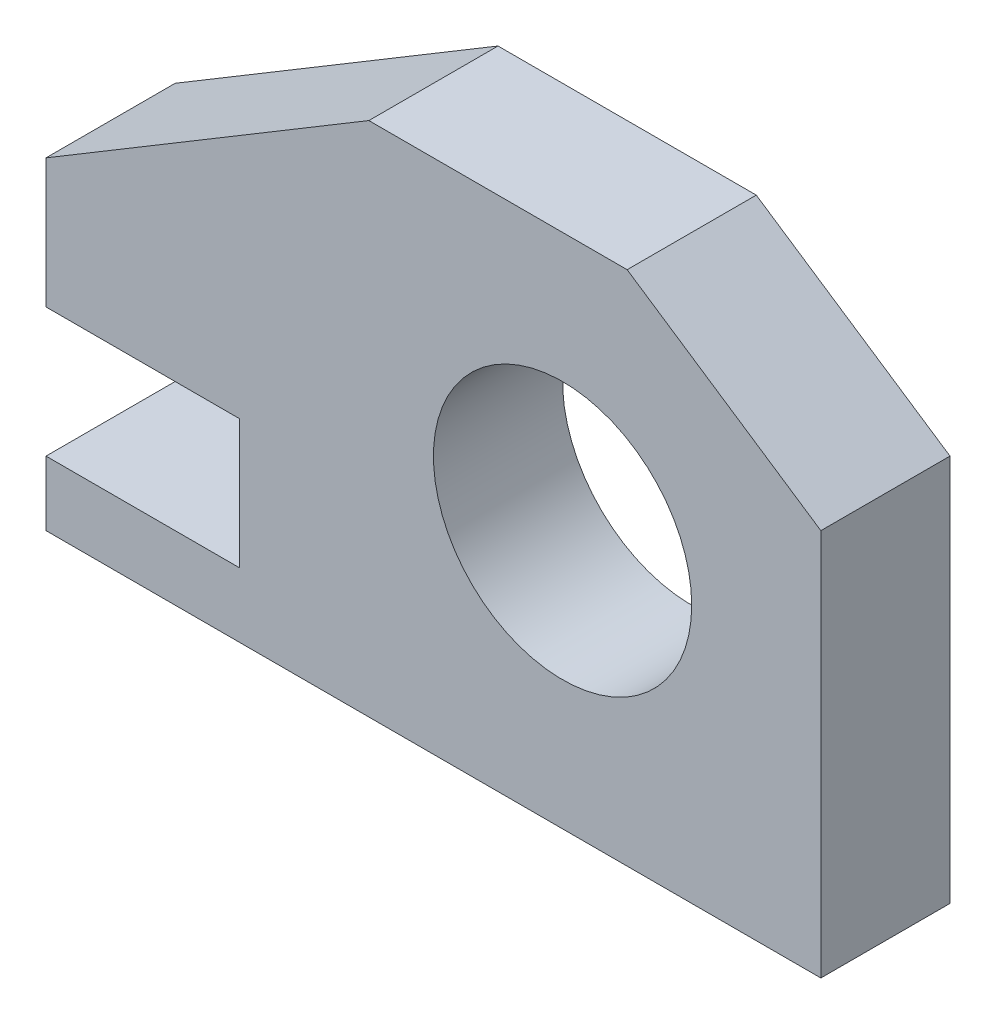
ISO-10303-21;
HEADER;
FILE_DESCRIPTION(('STEP AP214'),'2;1');
FILE_NAME('part.step','',(''),(''),'','','');
FILE_SCHEMA(('AUTOMOTIVE_DESIGN { 1 0 10303 214 1 1 1 1 }'));
ENDSEC;
DATA;
#1=APPLICATION_CONTEXT('core data for automotive mechanical design processes');
#2=APPLICATION_PROTOCOL_DEFINITION('international standard','automotive_design',2000,#1);
#3=PRODUCT_CONTEXT('',#1,'mechanical');
#4=PRODUCT('Part','Part','',(#3));
#5=PRODUCT_RELATED_PRODUCT_CATEGORY('part','',(#4));
#6=PRODUCT_DEFINITION_FORMATION('','',#4);
#7=PRODUCT_DEFINITION_CONTEXT('part definition',#1,'design');
#8=PRODUCT_DEFINITION('design','',#6,#7);
#9=PRODUCT_DEFINITION_SHAPE('','',#8);
#10=(LENGTH_UNIT() NAMED_UNIT(*) SI_UNIT(.MILLI.,.METRE.));
#11=(NAMED_UNIT(*) PLANE_ANGLE_UNIT() SI_UNIT($,.RADIAN.));
#12=(NAMED_UNIT(*) SI_UNIT($,.STERADIAN.) SOLID_ANGLE_UNIT());
#13=UNCERTAINTY_MEASURE_WITH_UNIT(LENGTH_MEASURE(1.E-05),#10,'distance_accuracy_value','');
#14=(GEOMETRIC_REPRESENTATION_CONTEXT(3) GLOBAL_UNCERTAINTY_ASSIGNED_CONTEXT((#13)) GLOBAL_UNIT_ASSIGNED_CONTEXT((#10,
#11,#12)) REPRESENTATION_CONTEXT('',''));
#15=CARTESIAN_POINT('',(0.,0.,0.));
#16=DIRECTION('',(0.,0.,1.));
#17=DIRECTION('',(1.,0.,0.));
#18=AXIS2_PLACEMENT_3D('',#15,#16,#17);
#19=CARTESIAN_POINT('',(57.15,50.8,12.7));
#20=DIRECTION('',(0.,-1.,0.));
#21=DIRECTION('',(0.,0.,-1.));
#22=AXIS2_PLACEMENT_3D('',#19,#20,#21);
#23=PLANE('',#22);
#24=DIRECTION('',(-1.,0.,0.));
#25=VECTOR('',#24,1.);
#26=CARTESIAN_POINT('',(57.15,50.8,0.));
#27=LINE('',#26,#25);
#28=CARTESIAN_POINT('',(57.15,50.8,0.));
#29=VERTEX_POINT('',#28);
#30=CARTESIAN_POINT('',(31.75,50.8,0.));
#31=VERTEX_POINT('',#30);
#32=EDGE_CURVE('E152',#29,#31,#27,.T.);
#33=ORIENTED_EDGE('',*,*,#32,.T.);
#34=DIRECTION('',(0.,0.,-1.));
#35=VECTOR('',#34,1.);
#36=CARTESIAN_POINT('',(31.75,50.8,12.7));
#37=LINE('',#36,#35);
#38=CARTESIAN_POINT('',(31.75,50.8,12.7));
#39=VERTEX_POINT('',#38);
#40=EDGE_CURVE('E11',#39,#31,#37,.T.);
#41=ORIENTED_EDGE('',*,*,#40,.F.);
#42=DIRECTION('',(-1.,0.,0.));
#43=VECTOR('',#42,1.);
#44=CARTESIAN_POINT('',(57.15,50.8,12.7));
#45=LINE('',#44,#43);
#46=CARTESIAN_POINT('',(57.15,50.8,12.7));
#47=VERTEX_POINT('',#46);
#48=EDGE_CURVE('E181',#47,#39,#45,.T.);
#49=ORIENTED_EDGE('',*,*,#48,.F.);
#50=DIRECTION('',(0.,0.,-1.));
#51=VECTOR('',#50,1.);
#52=CARTESIAN_POINT('',(57.15,50.8,12.7));
#53=LINE('',#52,#51);
#54=EDGE_CURVE('E148',#47,#29,#53,.T.);
#55=ORIENTED_EDGE('',*,*,#54,.T.);
#56=EDGE_LOOP('',(#33,#41,#49,#55));
#57=FACE_BOUND('',#56,.T.);
#58=ADVANCED_FACE('F39',(#57),#23,.F.);
#59=CARTESIAN_POINT('',(31.75,50.8,12.7));
#60=DIRECTION('',(0.514495755427526,-0.857492925712544,0.));
#61=DIRECTION('',(0.857492925712544,0.514495755427526,0.));
#62=AXIS2_PLACEMENT_3D('',#59,#60,#61);
#63=PLANE('',#62);
#64=DIRECTION('',(-0.857492925712544,-0.514495755427526,0.));
#65=VECTOR('',#64,1.);
#66=CARTESIAN_POINT('',(31.75,50.8,0.));
#67=LINE('',#66,#65);
#68=CARTESIAN_POINT('',(0.,31.75,0.));
#69=VERTEX_POINT('',#68);
#70=EDGE_CURVE('E156',#31,#69,#67,.T.);
#71=ORIENTED_EDGE('',*,*,#70,.T.);
#72=DIRECTION('',(0.,0.,-1.));
#73=VECTOR('',#72,1.);
#74=CARTESIAN_POINT('',(0.,31.75,12.7));
#75=LINE('',#74,#73);
#76=CARTESIAN_POINT('',(0.,31.75,12.7));
#77=VERTEX_POINT('',#76);
#78=EDGE_CURVE('E48',#77,#69,#75,.T.);
#79=ORIENTED_EDGE('',*,*,#78,.F.);
#80=DIRECTION('',(-0.857492925712544,-0.514495755427526,0.));
#81=VECTOR('',#80,1.);
#82=CARTESIAN_POINT('',(31.75,50.8,12.7));
#83=LINE('',#82,#81);
#84=EDGE_CURVE('E105',#39,#77,#83,.T.);
#85=ORIENTED_EDGE('',*,*,#84,.F.);
#86=ORIENTED_EDGE('',*,*,#40,.T.);
#87=EDGE_LOOP('',(#71,#79,#85,#86));
#88=FACE_BOUND('',#87,.T.);
#89=ADVANCED_FACE('F268',(#88),#63,.F.);
#90=CARTESIAN_POINT('',(0.,31.75,12.7));
#91=DIRECTION('',(1.,0.,0.));
#92=DIRECTION('',(0.,1.,0.));
#93=AXIS2_PLACEMENT_3D('',#90,#91,#92);
#94=PLANE('',#93);
#95=DIRECTION('',(0.,-1.,0.));
#96=VECTOR('',#95,1.);
#97=CARTESIAN_POINT('',(0.,31.75,0.));
#98=LINE('',#97,#96);
#99=CARTESIAN_POINT('',(0.,19.05,0.));
#100=VERTEX_POINT('',#99);
#101=EDGE_CURVE('E160',#69,#100,#98,.T.);
#102=ORIENTED_EDGE('',*,*,#101,.T.);
#103=DIRECTION('',(0.,0.,-1.));
#104=VECTOR('',#103,1.);
#105=CARTESIAN_POINT('',(0.,19.05,12.7));
#106=LINE('',#105,#104);
#107=CARTESIAN_POINT('',(0.,19.05,12.7));
#108=VERTEX_POINT('',#107);
#109=EDGE_CURVE('E200',#108,#100,#106,.T.);
#110=ORIENTED_EDGE('',*,*,#109,.F.);
#111=DIRECTION('',(0.,-1.,0.));
#112=VECTOR('',#111,1.);
#113=CARTESIAN_POINT('',(0.,31.75,12.7));
#114=LINE('',#113,#112);
#115=EDGE_CURVE('E210',#77,#108,#114,.T.);
#116=ORIENTED_EDGE('',*,*,#115,.F.);
#117=ORIENTED_EDGE('',*,*,#78,.T.);
#118=EDGE_LOOP('',(#102,#110,#116,#117));
#119=FACE_BOUND('',#118,.T.);
#120=ADVANCED_FACE('F208',(#119),#94,.F.);
#121=CARTESIAN_POINT('',(0.,19.05,12.7));
#122=DIRECTION('',(0.,1.,0.));
#123=DIRECTION('',(0.,0.,1.));
#124=AXIS2_PLACEMENT_3D('',#121,#122,#123);
#125=PLANE('',#124);
#126=DIRECTION('',(1.,0.,0.));
#127=VECTOR('',#126,1.);
#128=CARTESIAN_POINT('',(0.,19.05,0.));
#129=LINE('',#128,#127);
#130=CARTESIAN_POINT('',(19.05,19.05,0.));
#131=VERTEX_POINT('',#130);
#132=EDGE_CURVE('E163',#100,#131,#129,.T.);
#133=ORIENTED_EDGE('',*,*,#132,.T.);
#134=DIRECTION('',(0.,0.,-1.));
#135=VECTOR('',#134,1.);
#136=CARTESIAN_POINT('',(19.05,19.05,12.7));
#137=LINE('',#136,#135);
#138=CARTESIAN_POINT('',(19.05,19.05,12.7));
#139=VERTEX_POINT('',#138);
#140=EDGE_CURVE('E196',#139,#131,#137,.T.);
#141=ORIENTED_EDGE('',*,*,#140,.F.);
#142=DIRECTION('',(1.,0.,0.));
#143=VECTOR('',#142,1.);
#144=CARTESIAN_POINT('',(0.,19.05,12.7));
#145=LINE('',#144,#143);
#146=EDGE_CURVE('E229',#108,#139,#145,.T.);
#147=ORIENTED_EDGE('',*,*,#146,.F.);
#148=ORIENTED_EDGE('',*,*,#109,.T.);
#149=EDGE_LOOP('',(#133,#141,#147,#148));
#150=FACE_BOUND('',#149,.T.);
#151=ADVANCED_FACE('F219',(#150),#125,.F.);
#152=CARTESIAN_POINT('',(19.05,19.05,12.7));
#153=DIRECTION('',(1.,0.,0.));
#154=DIRECTION('',(0.,1.,0.));
#155=AXIS2_PLACEMENT_3D('',#152,#153,#154);
#156=PLANE('',#155);
#157=DIRECTION('',(0.,-1.,0.));
#158=VECTOR('',#157,1.);
#159=CARTESIAN_POINT('',(19.05,19.05,0.));
#160=LINE('',#159,#158);
#161=CARTESIAN_POINT('',(19.05,6.35,0.));
#162=VERTEX_POINT('',#161);
#163=EDGE_CURVE('E166',#131,#162,#160,.T.);
#164=ORIENTED_EDGE('',*,*,#163,.T.);
#165=DIRECTION('',(0.,0.,-1.));
#166=VECTOR('',#165,1.);
#167=CARTESIAN_POINT('',(19.05,6.35,12.7));
#168=LINE('',#167,#166);
#169=CARTESIAN_POINT('',(19.05,6.35,12.7));
#170=VERTEX_POINT('',#169);
#171=EDGE_CURVE('E192',#170,#162,#168,.T.);
#172=ORIENTED_EDGE('',*,*,#171,.F.);
#173=DIRECTION('',(0.,-1.,0.));
#174=VECTOR('',#173,1.);
#175=CARTESIAN_POINT('',(19.05,19.05,12.7));
#176=LINE('',#175,#174);
#177=EDGE_CURVE('E225',#139,#170,#176,.T.);
#178=ORIENTED_EDGE('',*,*,#177,.F.);
#179=ORIENTED_EDGE('',*,*,#140,.T.);
#180=EDGE_LOOP('',(#164,#172,#178,#179));
#181=FACE_BOUND('',#180,.T.);
#182=ADVANCED_FACE('F223',(#181),#156,.F.);
#183=CARTESIAN_POINT('',(19.05,6.35,12.7));
#184=DIRECTION('',(0.,-1.,0.));
#185=DIRECTION('',(1.,0.,0.));
#186=AXIS2_PLACEMENT_3D('',#183,#184,#185);
#187=PLANE('',#186);
#188=DIRECTION('',(-1.,0.,0.));
#189=VECTOR('',#188,1.);
#190=CARTESIAN_POINT('',(19.05,6.35,0.));
#191=LINE('',#190,#189);
#192=CARTESIAN_POINT('',(0.,6.35,0.));
#193=VERTEX_POINT('',#192);
#194=EDGE_CURVE('E169',#162,#193,#191,.T.);
#195=ORIENTED_EDGE('',*,*,#194,.T.);
#196=DIRECTION('',(0.,0.,-1.));
#197=VECTOR('',#196,1.);
#198=CARTESIAN_POINT('',(0.,6.35,12.7));
#199=LINE('',#198,#197);
#200=CARTESIAN_POINT('',(0.,6.35,12.7));
#201=VERTEX_POINT('',#200);
#202=EDGE_CURVE('E188',#201,#193,#199,.T.);
#203=ORIENTED_EDGE('',*,*,#202,.F.);
#204=DIRECTION('',(-1.,0.,0.));
#205=VECTOR('',#204,1.);
#206=CARTESIAN_POINT('',(19.05,6.35,12.7));
#207=LINE('',#206,#205);
#208=EDGE_CURVE('E228',#170,#201,#207,.T.);
#209=ORIENTED_EDGE('',*,*,#208,.F.);
#210=ORIENTED_EDGE('',*,*,#171,.T.);
#211=EDGE_LOOP('',(#195,#203,#209,#210));
#212=FACE_BOUND('',#211,.T.);
#213=ADVANCED_FACE('F280',(#212),#187,.F.);
#214=CARTESIAN_POINT('',(0.,6.35,12.7));
#215=DIRECTION('',(1.,0.,0.));
#216=DIRECTION('',(0.,1.,0.));
#217=AXIS2_PLACEMENT_3D('',#214,#215,#216);
#218=PLANE('',#217);
#219=DIRECTION('',(0.,-1.,0.));
#220=VECTOR('',#219,1.);
#221=CARTESIAN_POINT('',(0.,6.35,0.));
#222=LINE('',#221,#220);
#223=CARTESIAN_POINT('',(0.,0.,0.));
#224=VERTEX_POINT('',#223);
#225=EDGE_CURVE('E172',#193,#224,#222,.T.);
#226=ORIENTED_EDGE('',*,*,#225,.T.);
#227=DIRECTION('',(0.,0.,-1.));
#228=VECTOR('',#227,1.);
#229=CARTESIAN_POINT('',(0.,0.,12.7));
#230=LINE('',#229,#228);
#231=CARTESIAN_POINT('',(0.,0.,12.7));
#232=VERTEX_POINT('',#231);
#233=EDGE_CURVE('E141',#232,#224,#230,.T.);
#234=ORIENTED_EDGE('',*,*,#233,.F.);
#235=DIRECTION('',(0.,-1.,0.));
#236=VECTOR('',#235,1.);
#237=CARTESIAN_POINT('',(0.,6.35,12.7));
#238=LINE('',#237,#236);
#239=EDGE_CURVE('E130',#201,#232,#238,.T.);
#240=ORIENTED_EDGE('',*,*,#239,.F.);
#241=ORIENTED_EDGE('',*,*,#202,.T.);
#242=EDGE_LOOP('',(#226,#234,#240,#241));
#243=FACE_BOUND('',#242,.T.);
#244=ADVANCED_FACE('F277',(#243),#218,.F.);
#245=CARTESIAN_POINT('',(0.,0.,12.7));
#246=DIRECTION('',(0.,1.,0.));
#247=DIRECTION('',(0.,0.,1.));
#248=AXIS2_PLACEMENT_3D('',#245,#246,#247);
#249=PLANE('',#248);
#250=DIRECTION('',(1.,0.,0.));
#251=VECTOR('',#250,1.);
#252=CARTESIAN_POINT('',(0.,0.,0.));
#253=LINE('',#252,#251);
#254=CARTESIAN_POINT('',(76.2,0.,0.));
#255=VERTEX_POINT('',#254);
#256=EDGE_CURVE('E139',#224,#255,#253,.T.);
#257=ORIENTED_EDGE('',*,*,#256,.T.);
#258=DIRECTION('',(0.,0.,-1.));
#259=VECTOR('',#258,1.);
#260=CARTESIAN_POINT('',(76.2,0.,12.7));
#261=LINE('',#260,#259);
#262=CARTESIAN_POINT('',(76.2,0.,12.7));
#263=VERTEX_POINT('',#262);
#264=EDGE_CURVE('E136',#263,#255,#261,.T.);
#265=ORIENTED_EDGE('',*,*,#264,.F.);
#266=DIRECTION('',(1.,0.,0.));
#267=VECTOR('',#266,1.);
#268=CARTESIAN_POINT('',(0.,0.,12.7));
#269=LINE('',#268,#267);
#270=EDGE_CURVE('E124',#232,#263,#269,.T.);
#271=ORIENTED_EDGE('',*,*,#270,.F.);
#272=ORIENTED_EDGE('',*,*,#233,.T.);
#273=EDGE_LOOP('',(#257,#265,#271,#272));
#274=FACE_BOUND('',#273,.T.);
#275=ADVANCED_FACE('F137',(#274),#249,.F.);
#276=CARTESIAN_POINT('',(76.2,0.,12.7));
#277=DIRECTION('',(-1.,0.,0.));
#278=DIRECTION('',(0.,0.,1.));
#279=AXIS2_PLACEMENT_3D('',#276,#277,#278);
#280=PLANE('',#279);
#281=DIRECTION('',(0.,1.,0.));
#282=VECTOR('',#281,1.);
#283=CARTESIAN_POINT('',(76.2,0.,0.));
#284=LINE('',#283,#282);
#285=CARTESIAN_POINT('',(76.2,38.1,0.));
#286=VERTEX_POINT('',#285);
#287=EDGE_CURVE('E91',#255,#286,#284,.T.);
#288=ORIENTED_EDGE('',*,*,#287,.T.);
#289=DIRECTION('',(0.,0.,-1.));
#290=VECTOR('',#289,1.);
#291=CARTESIAN_POINT('',(76.2,38.1,12.7));
#292=LINE('',#291,#290);
#293=CARTESIAN_POINT('',(76.2,38.1,12.7));
#294=VERTEX_POINT('',#293);
#295=EDGE_CURVE('E142',#294,#286,#292,.T.);
#296=ORIENTED_EDGE('',*,*,#295,.F.);
#297=DIRECTION('',(0.,1.,0.));
#298=VECTOR('',#297,1.);
#299=CARTESIAN_POINT('',(76.2,0.,12.7));
#300=LINE('',#299,#298);
#301=EDGE_CURVE('E128',#263,#294,#300,.T.);
#302=ORIENTED_EDGE('',*,*,#301,.F.);
#303=ORIENTED_EDGE('',*,*,#264,.T.);
#304=EDGE_LOOP('',(#288,#296,#302,#303));
#305=FACE_BOUND('',#304,.T.);
#306=ADVANCED_FACE('F144',(#305),#280,.F.);
#307=CARTESIAN_POINT('',(76.2,38.1,12.7));
#308=DIRECTION('',(-0.554700196225229,-0.832050294337844,0.));
#309=DIRECTION('',(0.832050294337844,-0.554700196225229,0.));
#310=AXIS2_PLACEMENT_3D('',#307,#308,#309);
#311=PLANE('',#310);
#312=DIRECTION('',(-0.832050294337844,0.554700196225229,0.));
#313=VECTOR('',#312,1.);
#314=CARTESIAN_POINT('',(76.2,38.1,0.));
#315=LINE('',#314,#313);
#316=EDGE_CURVE('E97',#286,#29,#315,.T.);
#317=ORIENTED_EDGE('',*,*,#316,.T.);
#318=ORIENTED_EDGE('',*,*,#54,.F.);
#319=DIRECTION('',(-0.832050294337844,0.554700196225229,0.));
#320=VECTOR('',#319,1.);
#321=CARTESIAN_POINT('',(76.2,38.1,12.7));
#322=LINE('',#321,#320);
#323=EDGE_CURVE('E56',#294,#47,#322,.T.);
#324=ORIENTED_EDGE('',*,*,#323,.F.);
#325=ORIENTED_EDGE('',*,*,#295,.T.);
#326=EDGE_LOOP('',(#317,#318,#324,#325));
#327=FACE_BOUND('',#326,.T.);
#328=ADVANCED_FACE('F259',(#327),#311,.F.);
#329=CARTESIAN_POINT('',(0.,0.,12.7));
#330=DIRECTION('',(0.,0.,1.));
#331=DIRECTION('',(1.,0.,0.));
#332=AXIS2_PLACEMENT_3D('',#329,#330,#331);
#333=PLANE('',#332);
#334=CARTESIAN_POINT('',(50.8,25.4,12.7));
#335=DIRECTION('',(0.,0.,1.));
#336=DIRECTION('',(1.,0.,0.));
#337=AXIS2_PLACEMENT_3D('',#334,#335,#336);
#338=CIRCLE('',#337,12.7);
#339=CARTESIAN_POINT('',(63.5,25.4,12.7));
#340=VERTEX_POINT('',#339);
#341=EDGE_CURVE('E243',#340,#340,#338,.T.);
#342=ORIENTED_EDGE('',*,*,#341,.F.);
#343=EDGE_LOOP('',(#342));
#344=FACE_BOUND('',#343,.T.);
#345=ORIENTED_EDGE('',*,*,#48,.T.);
#346=ORIENTED_EDGE('',*,*,#84,.T.);
#347=ORIENTED_EDGE('',*,*,#115,.T.);
#348=ORIENTED_EDGE('',*,*,#146,.T.);
#349=ORIENTED_EDGE('',*,*,#177,.T.);
#350=ORIENTED_EDGE('',*,*,#208,.T.);
#351=ORIENTED_EDGE('',*,*,#239,.T.);
#352=ORIENTED_EDGE('',*,*,#270,.T.);
#353=ORIENTED_EDGE('',*,*,#301,.T.);
#354=ORIENTED_EDGE('',*,*,#323,.T.);
#355=EDGE_LOOP('',(#345,#346,#347,#348,#349,#350,#351,#352,#353,#354));
#356=FACE_BOUND('',#355,.T.);
#357=ADVANCED_FACE('F126',(#344,#356),#333,.T.);
#358=CARTESIAN_POINT('',(0.,0.,0.));
#359=DIRECTION('',(0.,0.,1.));
#360=DIRECTION('',(1.,0.,0.));
#361=AXIS2_PLACEMENT_3D('',#358,#359,#360);
#362=PLANE('',#361);
#363=CARTESIAN_POINT('',(50.8,25.4,0.));
#364=DIRECTION('',(0.,0.,1.));
#365=DIRECTION('',(1.,0.,0.));
#366=AXIS2_PLACEMENT_3D('',#363,#364,#365);
#367=CIRCLE('',#366,12.7);
#368=CARTESIAN_POINT('',(63.5,25.4,0.));
#369=VERTEX_POINT('',#368);
#370=EDGE_CURVE('E157',#369,#369,#367,.T.);
#371=ORIENTED_EDGE('',*,*,#370,.T.);
#372=EDGE_LOOP('',(#371));
#373=FACE_BOUND('',#372,.T.);
#374=ORIENTED_EDGE('',*,*,#32,.F.);
#375=ORIENTED_EDGE('',*,*,#316,.F.);
#376=ORIENTED_EDGE('',*,*,#287,.F.);
#377=ORIENTED_EDGE('',*,*,#256,.F.);
#378=ORIENTED_EDGE('',*,*,#225,.F.);
#379=ORIENTED_EDGE('',*,*,#194,.F.);
#380=ORIENTED_EDGE('',*,*,#163,.F.);
#381=ORIENTED_EDGE('',*,*,#132,.F.);
#382=ORIENTED_EDGE('',*,*,#101,.F.);
#383=ORIENTED_EDGE('',*,*,#70,.F.);
#384=EDGE_LOOP('',(#374,#375,#376,#377,#378,#379,#380,#381,#382,#383));
#385=FACE_BOUND('',#384,.T.);
#386=ADVANCED_FACE('F214',(#373,#385),#362,.F.);
#387=CARTESIAN_POINT('',(50.8,25.4,0.));
#388=DIRECTION('',(0.,0.,1.));
#389=DIRECTION('',(1.,0.,0.));
#390=AXIS2_PLACEMENT_3D('',#387,#388,#389);
#391=CYLINDRICAL_SURFACE('',#390,12.7);
#392=ORIENTED_EDGE('',*,*,#370,.F.);
#393=EDGE_LOOP('',(#392));
#394=FACE_BOUND('',#393,.T.);
#395=ORIENTED_EDGE('',*,*,#341,.T.);
#396=EDGE_LOOP('',(#395));
#397=FACE_BOUND('',#396,.T.);
#398=ADVANCED_FACE('F252',(#394,#397),#391,.F.);
#399=CLOSED_SHELL('',(#58,#89,#120,#151,#182,#213,#244,#275,#306,#328,#357,#386,#398));
#400=MANIFOLD_SOLID_BREP('B2',#399);
#401=ADVANCED_BREP_SHAPE_REPRESENTATION('',(#18,#400),#14);
#402=SHAPE_DEFINITION_REPRESENTATION(#9,#401);
ENDSEC;
END-ISO-10303-21;
